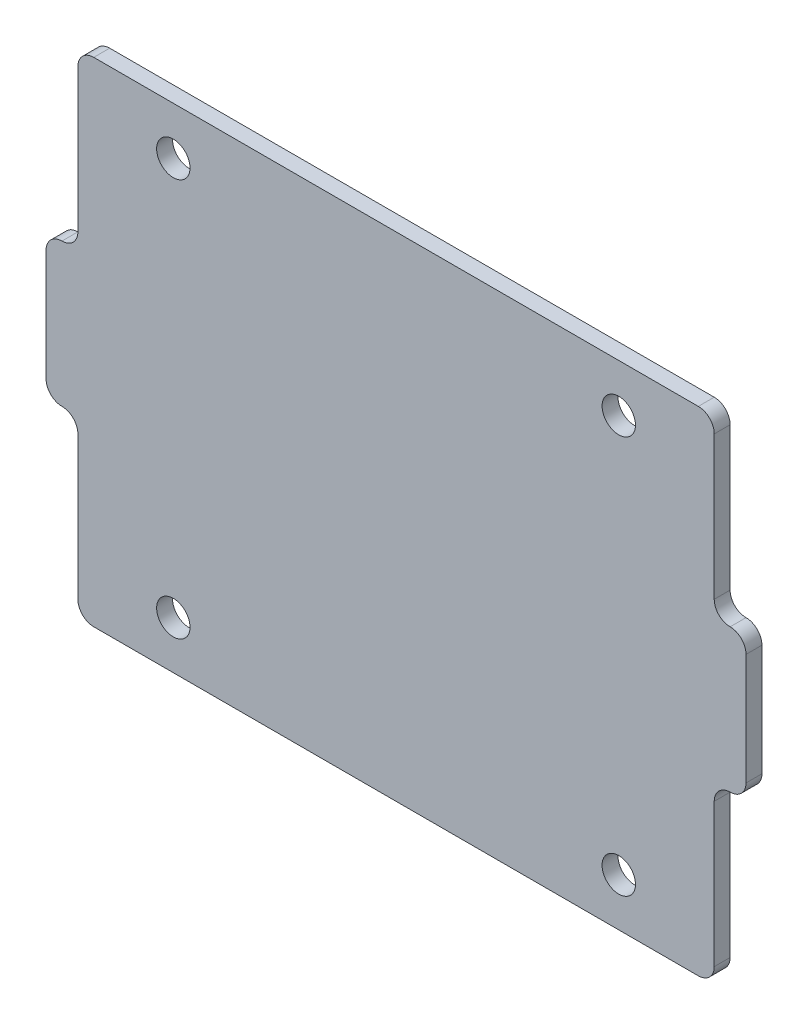
ISO-10303-21;
HEADER;
FILE_DESCRIPTION(('STEP AP214'),'2;1');
FILE_NAME('part.step','',(''),(''),'','','');
FILE_SCHEMA(('AUTOMOTIVE_DESIGN { 1 0 10303 214 1 1 1 1 }'));
ENDSEC;
DATA;
#1=APPLICATION_CONTEXT('core data for automotive mechanical design processes');
#2=APPLICATION_PROTOCOL_DEFINITION('international standard','automotive_design',2000,#1);
#3=PRODUCT_CONTEXT('',#1,'mechanical');
#4=PRODUCT('Part','Part','',(#3));
#5=PRODUCT_RELATED_PRODUCT_CATEGORY('part','',(#4));
#6=PRODUCT_DEFINITION_FORMATION('','',#4);
#7=PRODUCT_DEFINITION_CONTEXT('part definition',#1,'design');
#8=PRODUCT_DEFINITION('design','',#6,#7);
#9=PRODUCT_DEFINITION_SHAPE('','',#8);
#10=(LENGTH_UNIT() NAMED_UNIT(*) SI_UNIT(.MILLI.,.METRE.));
#11=(NAMED_UNIT(*) PLANE_ANGLE_UNIT() SI_UNIT($,.RADIAN.));
#12=(NAMED_UNIT(*) SI_UNIT($,.STERADIAN.) SOLID_ANGLE_UNIT());
#13=UNCERTAINTY_MEASURE_WITH_UNIT(LENGTH_MEASURE(1.E-05),#10,'distance_accuracy_value','');
#14=(GEOMETRIC_REPRESENTATION_CONTEXT(3) GLOBAL_UNCERTAINTY_ASSIGNED_CONTEXT((#13)) GLOBAL_UNIT_ASSIGNED_CONTEXT((#10,
#11,#12)) REPRESENTATION_CONTEXT('',''));
#15=CARTESIAN_POINT('',(0.,0.,0.));
#16=DIRECTION('',(0.,0.,1.));
#17=DIRECTION('',(1.,0.,0.));
#18=AXIS2_PLACEMENT_3D('',#15,#16,#17);
#19=CARTESIAN_POINT('',(-95.,26.,150.));
#20=DIRECTION('',(0.,0.,-1.));
#21=DIRECTION('',(-1.,0.,0.));
#22=AXIS2_PLACEMENT_3D('',#19,#20,#21);
#23=PLANE('',#22);
#24=DIRECTION('',(0.,1.,0.));
#25=VECTOR('',#24,1.);
#26=CARTESIAN_POINT('',(110.,121.,150.));
#27=LINE('',#26,#25);
#28=CARTESIAN_POINT('',(110.,81.0000000000001,150.));
#29=VERTEX_POINT('',#28);
#30=CARTESIAN_POINT('',(110.,116.,150.));
#31=VERTEX_POINT('',#30);
#32=EDGE_CURVE('E357',#29,#31,#27,.T.);
#33=ORIENTED_EDGE('',*,*,#32,.T.);
#34=CARTESIAN_POINT('',(105.,116.,150.));
#35=DIRECTION('',(0.,0.,-1.));
#36=DIRECTION('',(-1.,0.,0.));
#37=AXIS2_PLACEMENT_3D('',#34,#35,#36);
#38=CIRCLE('',#37,5.);
#39=CARTESIAN_POINT('',(105.,121.,150.));
#40=VERTEX_POINT('',#39);
#41=EDGE_CURVE('E224',#31,#40,#38,.F.);
#42=ORIENTED_EDGE('',*,*,#41,.T.);
#43=CARTESIAN_POINT('',(105.,126.,150.));
#44=DIRECTION('',(0.,0.,-1.));
#45=DIRECTION('',(-1.,0.,0.));
#46=AXIS2_PLACEMENT_3D('',#43,#44,#45);
#47=CIRCLE('',#46,5.);
#48=CARTESIAN_POINT('',(99.9999999999999,126.,150.));
#49=VERTEX_POINT('',#48);
#50=EDGE_CURVE('E240',#40,#49,#47,.T.);
#51=ORIENTED_EDGE('',*,*,#50,.T.);
#52=DIRECTION('',(0.,1.,0.));
#53=VECTOR('',#52,1.);
#54=CARTESIAN_POINT('',(100.,171.,150.));
#55=LINE('',#54,#53);
#56=CARTESIAN_POINT('',(100.,171.,150.));
#57=VERTEX_POINT('',#56);
#58=EDGE_CURVE('E361',#49,#57,#55,.T.);
#59=ORIENTED_EDGE('',*,*,#58,.T.);
#60=CARTESIAN_POINT('',(95.,171.,150.));
#61=DIRECTION('',(0.,0.,1.));
#62=DIRECTION('',(-1.,0.,0.));
#63=AXIS2_PLACEMENT_3D('',#60,#61,#62);
#64=CIRCLE('',#63,5.00000000000002);
#65=CARTESIAN_POINT('',(95.,176.,150.));
#66=VERTEX_POINT('',#65);
#67=EDGE_CURVE('E348',#57,#66,#64,.T.);
#68=ORIENTED_EDGE('',*,*,#67,.T.);
#69=DIRECTION('',(-1.,0.,0.));
#70=VECTOR('',#69,1.);
#71=CARTESIAN_POINT('',(-95.,176.,150.));
#72=LINE('',#71,#70);
#73=CARTESIAN_POINT('',(-95.,176.,150.));
#74=VERTEX_POINT('',#73);
#75=EDGE_CURVE('E344',#66,#74,#72,.T.);
#76=ORIENTED_EDGE('',*,*,#75,.T.);
#77=CARTESIAN_POINT('',(-95.,171.,150.));
#78=DIRECTION('',(0.,0.,1.));
#79=DIRECTION('',(-1.,0.,0.));
#80=AXIS2_PLACEMENT_3D('',#77,#78,#79);
#81=CIRCLE('',#80,5.00000000000002);
#82=CARTESIAN_POINT('',(-100.,171.,150.));
#83=VERTEX_POINT('',#82);
#84=EDGE_CURVE('E342',#74,#83,#81,.T.);
#85=ORIENTED_EDGE('',*,*,#84,.T.);
#86=DIRECTION('',(0.,-1.,0.));
#87=VECTOR('',#86,1.);
#88=CARTESIAN_POINT('',(-100.,171.,150.));
#89=LINE('',#88,#87);
#90=CARTESIAN_POINT('',(-100.,126.,150.));
#91=VERTEX_POINT('',#90);
#92=EDGE_CURVE('E343',#83,#91,#89,.T.);
#93=ORIENTED_EDGE('',*,*,#92,.T.);
#94=CARTESIAN_POINT('',(-105.,126.,150.));
#95=DIRECTION('',(0.,0.,-1.));
#96=DIRECTION('',(-1.,0.,0.));
#97=AXIS2_PLACEMENT_3D('',#94,#95,#96);
#98=CIRCLE('',#97,5.);
#99=CARTESIAN_POINT('',(-105.,121.,150.));
#100=VERTEX_POINT('',#99);
#101=EDGE_CURVE('E11',#91,#100,#98,.T.);
#102=ORIENTED_EDGE('',*,*,#101,.T.);
#103=CARTESIAN_POINT('',(-105.,116.,150.));
#104=DIRECTION('',(0.,0.,-1.));
#105=DIRECTION('',(-1.,0.,0.));
#106=AXIS2_PLACEMENT_3D('',#103,#104,#105);
#107=CIRCLE('',#106,5.);
#108=CARTESIAN_POINT('',(-110.,116.,150.));
#109=VERTEX_POINT('',#108);
#110=EDGE_CURVE('E219',#100,#109,#107,.F.);
#111=ORIENTED_EDGE('',*,*,#110,.T.);
#112=DIRECTION('',(0.,-1.,0.));
#113=VECTOR('',#112,1.);
#114=CARTESIAN_POINT('',(-110.,121.,150.));
#115=LINE('',#114,#113);
#116=CARTESIAN_POINT('',(-110.,81.0000000000001,150.));
#117=VERTEX_POINT('',#116);
#118=EDGE_CURVE('E346',#109,#117,#115,.T.);
#119=ORIENTED_EDGE('',*,*,#118,.T.);
#120=CARTESIAN_POINT('',(-105.,81.,150.));
#121=DIRECTION('',(0.,0.,-1.));
#122=DIRECTION('',(-1.,0.,0.));
#123=AXIS2_PLACEMENT_3D('',#120,#121,#122);
#124=CIRCLE('',#123,5.);
#125=CARTESIAN_POINT('',(-105.,76.,150.));
#126=VERTEX_POINT('',#125);
#127=EDGE_CURVE('E58',#117,#126,#124,.F.);
#128=ORIENTED_EDGE('',*,*,#127,.T.);
#129=CARTESIAN_POINT('',(-105.,71.,150.));
#130=DIRECTION('',(0.,0.,-1.));
#131=DIRECTION('',(-1.,0.,0.));
#132=AXIS2_PLACEMENT_3D('',#129,#130,#131);
#133=CIRCLE('',#132,5.);
#134=CARTESIAN_POINT('',(-100.,71.,150.));
#135=VERTEX_POINT('',#134);
#136=EDGE_CURVE('E53',#126,#135,#133,.T.);
#137=ORIENTED_EDGE('',*,*,#136,.T.);
#138=DIRECTION('',(0.,-1.,0.));
#139=VECTOR('',#138,1.);
#140=CARTESIAN_POINT('',(-100.,76.,150.));
#141=LINE('',#140,#139);
#142=CARTESIAN_POINT('',(-100.,26.,150.));
#143=VERTEX_POINT('',#142);
#144=EDGE_CURVE('E189',#135,#143,#141,.T.);
#145=ORIENTED_EDGE('',*,*,#144,.T.);
#146=CARTESIAN_POINT('',(-95.,26.,150.));
#147=DIRECTION('',(0.,0.,1.));
#148=DIRECTION('',(-1.,0.,0.));
#149=AXIS2_PLACEMENT_3D('',#146,#147,#148);
#150=CIRCLE('',#149,5.);
#151=CARTESIAN_POINT('',(-95.,21.,150.));
#152=VERTEX_POINT('',#151);
#153=EDGE_CURVE('E184',#143,#152,#150,.T.);
#154=ORIENTED_EDGE('',*,*,#153,.T.);
#155=DIRECTION('',(1.,0.,0.));
#156=VECTOR('',#155,1.);
#157=CARTESIAN_POINT('',(-95.,21.,150.));
#158=LINE('',#157,#156);
#159=CARTESIAN_POINT('',(95.,21.0000000000001,150.));
#160=VERTEX_POINT('',#159);
#161=EDGE_CURVE('E174',#152,#160,#158,.T.);
#162=ORIENTED_EDGE('',*,*,#161,.T.);
#163=CARTESIAN_POINT('',(95.,26.0000000000001,150.));
#164=DIRECTION('',(0.,0.,1.));
#165=DIRECTION('',(1.,0.,0.));
#166=AXIS2_PLACEMENT_3D('',#163,#164,#165);
#167=CIRCLE('',#166,5.);
#168=CARTESIAN_POINT('',(100.,26.0000000000001,150.));
#169=VERTEX_POINT('',#168);
#170=EDGE_CURVE('E183',#160,#169,#167,.T.);
#171=ORIENTED_EDGE('',*,*,#170,.T.);
#172=DIRECTION('',(0.,1.,0.));
#173=VECTOR('',#172,1.);
#174=CARTESIAN_POINT('',(100.,76.0000000000001,150.));
#175=LINE('',#174,#173);
#176=CARTESIAN_POINT('',(100.,71.0000000000001,150.));
#177=VERTEX_POINT('',#176);
#178=EDGE_CURVE('E316',#169,#177,#175,.T.);
#179=ORIENTED_EDGE('',*,*,#178,.T.);
#180=CARTESIAN_POINT('',(105.,71.0000000000001,150.));
#181=DIRECTION('',(0.,0.,-1.));
#182=DIRECTION('',(-1.,0.,0.));
#183=AXIS2_PLACEMENT_3D('',#180,#181,#182);
#184=CIRCLE('',#183,5.);
#185=CARTESIAN_POINT('',(105.,76.0000000000001,150.));
#186=VERTEX_POINT('',#185);
#187=EDGE_CURVE('E244',#177,#186,#184,.T.);
#188=ORIENTED_EDGE('',*,*,#187,.T.);
#189=CARTESIAN_POINT('',(105.,81.0000000000001,150.));
#190=DIRECTION('',(0.,0.,-1.));
#191=DIRECTION('',(-1.,0.,0.));
#192=AXIS2_PLACEMENT_3D('',#189,#190,#191);
#193=CIRCLE('',#192,5.);
#194=EDGE_CURVE('E222',#186,#29,#193,.F.);
#195=ORIENTED_EDGE('',*,*,#194,.T.);
#196=EDGE_LOOP('',(#33,#42,#51,#59,#68,#76,#85,#93,#102,#111,#119,#128,#137,#145,#154,#162,#171,
#179,#188,#195));
#197=FACE_BOUND('',#196,.T.);
#198=CARTESIAN_POINT('',(70.,161.,150.));
#199=DIRECTION('',(0.,0.,1.));
#200=DIRECTION('',(1.,0.,0.));
#201=AXIS2_PLACEMENT_3D('',#198,#199,#200);
#202=CIRCLE('',#201,5.25000000000002);
#203=CARTESIAN_POINT('',(75.25,161.,150.));
#204=VERTEX_POINT('',#203);
#205=EDGE_CURVE('E354',#204,#204,#202,.T.);
#206=ORIENTED_EDGE('',*,*,#205,.F.);
#207=EDGE_LOOP('',(#206));
#208=FACE_BOUND('',#207,.T.);
#209=CARTESIAN_POINT('',(70.,36.,150.));
#210=DIRECTION('',(0.,0.,1.));
#211=DIRECTION('',(1.,0.,0.));
#212=AXIS2_PLACEMENT_3D('',#209,#210,#211);
#213=CIRCLE('',#212,5.24999999999997);
#214=CARTESIAN_POINT('',(75.25,36.,150.));
#215=VERTEX_POINT('',#214);
#216=EDGE_CURVE('E465',#215,#215,#213,.T.);
#217=ORIENTED_EDGE('',*,*,#216,.F.);
#218=EDGE_LOOP('',(#217));
#219=FACE_BOUND('',#218,.T.);
#220=CARTESIAN_POINT('',(-70.,36.,150.));
#221=DIRECTION('',(0.,0.,1.));
#222=DIRECTION('',(1.,0.,0.));
#223=AXIS2_PLACEMENT_3D('',#220,#221,#222);
#224=CIRCLE('',#223,5.25);
#225=CARTESIAN_POINT('',(-64.75,36.,150.));
#226=VERTEX_POINT('',#225);
#227=EDGE_CURVE('E469',#226,#226,#224,.T.);
#228=ORIENTED_EDGE('',*,*,#227,.F.);
#229=EDGE_LOOP('',(#228));
#230=FACE_BOUND('',#229,.T.);
#231=CARTESIAN_POINT('',(-70.,161.,150.));
#232=DIRECTION('',(0.,0.,1.));
#233=DIRECTION('',(1.,0.,0.));
#234=AXIS2_PLACEMENT_3D('',#231,#232,#233);
#235=CIRCLE('',#234,5.25);
#236=CARTESIAN_POINT('',(-64.75,161.,150.));
#237=VERTEX_POINT('',#236);
#238=EDGE_CURVE('E490',#237,#237,#235,.T.);
#239=ORIENTED_EDGE('',*,*,#238,.F.);
#240=EDGE_LOOP('',(#239));
#241=FACE_BOUND('',#240,.T.);
#242=ADVANCED_FACE('F36',(#197,#208,#219,#230,#241),#23,.F.);
#243=CARTESIAN_POINT('',(-95.,26.,145.));
#244=DIRECTION('',(0.,0.,-1.));
#245=DIRECTION('',(-1.,0.,0.));
#246=AXIS2_PLACEMENT_3D('',#243,#244,#245);
#247=PLANE('',#246);
#248=CARTESIAN_POINT('',(-70.,36.,145.));
#249=DIRECTION('',(0.,0.,1.));
#250=DIRECTION('',(1.,0.,0.));
#251=AXIS2_PLACEMENT_3D('',#248,#249,#250);
#252=CIRCLE('',#251,5.25);
#253=CARTESIAN_POINT('',(-64.75,36.,145.));
#254=VERTEX_POINT('',#253);
#255=EDGE_CURVE('E474',#254,#254,#252,.T.);
#256=ORIENTED_EDGE('',*,*,#255,.T.);
#257=EDGE_LOOP('',(#256));
#258=FACE_BOUND('',#257,.T.);
#259=CARTESIAN_POINT('',(70.,161.,145.));
#260=DIRECTION('',(0.,0.,1.));
#261=DIRECTION('',(1.,0.,0.));
#262=AXIS2_PLACEMENT_3D('',#259,#260,#261);
#263=CIRCLE('',#262,5.25000000000002);
#264=CARTESIAN_POINT('',(75.25,161.,145.));
#265=VERTEX_POINT('',#264);
#266=EDGE_CURVE('E471',#265,#265,#263,.T.);
#267=ORIENTED_EDGE('',*,*,#266,.T.);
#268=EDGE_LOOP('',(#267));
#269=FACE_BOUND('',#268,.T.);
#270=DIRECTION('',(0.,1.,0.));
#271=VECTOR('',#270,1.);
#272=CARTESIAN_POINT('',(100.,171.,145.));
#273=LINE('',#272,#271);
#274=CARTESIAN_POINT('',(99.9999999999999,126.,145.));
#275=VERTEX_POINT('',#274);
#276=CARTESIAN_POINT('',(100.,171.,145.));
#277=VERTEX_POINT('',#276);
#278=EDGE_CURVE('E324',#275,#277,#273,.T.);
#279=ORIENTED_EDGE('',*,*,#278,.F.);
#280=CARTESIAN_POINT('',(105.,126.,145.));
#281=DIRECTION('',(0.,0.,-1.));
#282=DIRECTION('',(-1.,0.,0.));
#283=AXIS2_PLACEMENT_3D('',#280,#281,#282);
#284=CIRCLE('',#283,5.);
#285=CARTESIAN_POINT('',(105.,121.,145.));
#286=VERTEX_POINT('',#285);
#287=EDGE_CURVE('E238',#275,#286,#284,.F.);
#288=ORIENTED_EDGE('',*,*,#287,.T.);
#289=CARTESIAN_POINT('',(105.,116.,145.));
#290=DIRECTION('',(0.,0.,-1.));
#291=DIRECTION('',(-1.,0.,0.));
#292=AXIS2_PLACEMENT_3D('',#289,#290,#291);
#293=CIRCLE('',#292,5.);
#294=CARTESIAN_POINT('',(110.,116.,145.));
#295=VERTEX_POINT('',#294);
#296=EDGE_CURVE('E212',#286,#295,#293,.T.);
#297=ORIENTED_EDGE('',*,*,#296,.T.);
#298=DIRECTION('',(0.,1.,0.));
#299=VECTOR('',#298,1.);
#300=CARTESIAN_POINT('',(110.,121.,145.));
#301=LINE('',#300,#299);
#302=CARTESIAN_POINT('',(110.,81.0000000000001,145.));
#303=VERTEX_POINT('',#302);
#304=EDGE_CURVE('E321',#303,#295,#301,.T.);
#305=ORIENTED_EDGE('',*,*,#304,.F.);
#306=CARTESIAN_POINT('',(105.,81.0000000000001,145.));
#307=DIRECTION('',(0.,0.,-1.));
#308=DIRECTION('',(-1.,0.,0.));
#309=AXIS2_PLACEMENT_3D('',#306,#307,#308);
#310=CIRCLE('',#309,5.);
#311=CARTESIAN_POINT('',(105.,76.0000000000001,145.));
#312=VERTEX_POINT('',#311);
#313=EDGE_CURVE('E210',#303,#312,#310,.T.);
#314=ORIENTED_EDGE('',*,*,#313,.T.);
#315=CARTESIAN_POINT('',(105.,71.0000000000001,145.));
#316=DIRECTION('',(0.,0.,-1.));
#317=DIRECTION('',(-1.,0.,0.));
#318=AXIS2_PLACEMENT_3D('',#315,#316,#317);
#319=CIRCLE('',#318,5.);
#320=CARTESIAN_POINT('',(100.,71.0000000000001,145.));
#321=VERTEX_POINT('',#320);
#322=EDGE_CURVE('E242',#312,#321,#319,.F.);
#323=ORIENTED_EDGE('',*,*,#322,.T.);
#324=DIRECTION('',(0.,1.,0.));
#325=VECTOR('',#324,1.);
#326=CARTESIAN_POINT('',(100.,76.0000000000001,145.));
#327=LINE('',#326,#325);
#328=CARTESIAN_POINT('',(100.,26.0000000000001,145.));
#329=VERTEX_POINT('',#328);
#330=EDGE_CURVE('E313',#329,#321,#327,.T.);
#331=ORIENTED_EDGE('',*,*,#330,.F.);
#332=CARTESIAN_POINT('',(95.,26.0000000000001,145.));
#333=DIRECTION('',(0.,0.,1.));
#334=DIRECTION('',(1.,0.,0.));
#335=AXIS2_PLACEMENT_3D('',#332,#333,#334);
#336=CIRCLE('',#335,5.);
#337=CARTESIAN_POINT('',(95.,21.0000000000001,145.));
#338=VERTEX_POINT('',#337);
#339=EDGE_CURVE('E319',#338,#329,#336,.T.);
#340=ORIENTED_EDGE('',*,*,#339,.F.);
#341=DIRECTION('',(1.,0.,0.));
#342=VECTOR('',#341,1.);
#343=CARTESIAN_POINT('',(-95.,21.,145.));
#344=LINE('',#343,#342);
#345=CARTESIAN_POINT('',(-95.,21.,145.));
#346=VERTEX_POINT('',#345);
#347=EDGE_CURVE('E326',#346,#338,#344,.T.);
#348=ORIENTED_EDGE('',*,*,#347,.F.);
#349=CARTESIAN_POINT('',(-95.,26.,145.));
#350=DIRECTION('',(0.,0.,1.));
#351=DIRECTION('',(-1.,0.,0.));
#352=AXIS2_PLACEMENT_3D('',#349,#350,#351);
#353=CIRCLE('',#352,5.);
#354=CARTESIAN_POINT('',(-100.,26.,145.));
#355=VERTEX_POINT('',#354);
#356=EDGE_CURVE('E197',#355,#346,#353,.T.);
#357=ORIENTED_EDGE('',*,*,#356,.F.);
#358=DIRECTION('',(0.,-1.,0.));
#359=VECTOR('',#358,1.);
#360=CARTESIAN_POINT('',(-100.,76.,145.));
#361=LINE('',#360,#359);
#362=CARTESIAN_POINT('',(-100.,71.,145.));
#363=VERTEX_POINT('',#362);
#364=EDGE_CURVE('E193',#363,#355,#361,.T.);
#365=ORIENTED_EDGE('',*,*,#364,.F.);
#366=CARTESIAN_POINT('',(-105.,71.,145.));
#367=DIRECTION('',(0.,0.,-1.));
#368=DIRECTION('',(-1.,0.,0.));
#369=AXIS2_PLACEMENT_3D('',#366,#367,#368);
#370=CIRCLE('',#369,5.);
#371=CARTESIAN_POINT('',(-105.,76.,145.));
#372=VERTEX_POINT('',#371);
#373=EDGE_CURVE('E246',#363,#372,#370,.F.);
#374=ORIENTED_EDGE('',*,*,#373,.T.);
#375=CARTESIAN_POINT('',(-105.,81.,145.));
#376=DIRECTION('',(0.,0.,-1.));
#377=DIRECTION('',(-1.,0.,0.));
#378=AXIS2_PLACEMENT_3D('',#375,#376,#377);
#379=CIRCLE('',#378,5.);
#380=CARTESIAN_POINT('',(-110.,81.0000000000001,145.));
#381=VERTEX_POINT('',#380);
#382=EDGE_CURVE('E208',#372,#381,#379,.T.);
#383=ORIENTED_EDGE('',*,*,#382,.T.);
#384=DIRECTION('',(0.,-1.,0.));
#385=VECTOR('',#384,1.);
#386=CARTESIAN_POINT('',(-110.,121.,145.));
#387=LINE('',#386,#385);
#388=CARTESIAN_POINT('',(-110.,116.,145.));
#389=VERTEX_POINT('',#388);
#390=EDGE_CURVE('E285',#389,#381,#387,.T.);
#391=ORIENTED_EDGE('',*,*,#390,.F.);
#392=CARTESIAN_POINT('',(-105.,116.,145.));
#393=DIRECTION('',(0.,0.,-1.));
#394=DIRECTION('',(-1.,0.,0.));
#395=AXIS2_PLACEMENT_3D('',#392,#393,#394);
#396=CIRCLE('',#395,5.);
#397=CARTESIAN_POINT('',(-105.,121.,145.));
#398=VERTEX_POINT('',#397);
#399=EDGE_CURVE('E201',#389,#398,#396,.T.);
#400=ORIENTED_EDGE('',*,*,#399,.T.);
#401=CARTESIAN_POINT('',(-105.,126.,145.));
#402=DIRECTION('',(0.,0.,-1.));
#403=DIRECTION('',(-1.,0.,0.));
#404=AXIS2_PLACEMENT_3D('',#401,#402,#403);
#405=CIRCLE('',#404,5.);
#406=CARTESIAN_POINT('',(-100.,126.,145.));
#407=VERTEX_POINT('',#406);
#408=EDGE_CURVE('E45',#398,#407,#405,.F.);
#409=ORIENTED_EDGE('',*,*,#408,.T.);
#410=DIRECTION('',(0.,-1.,0.));
#411=VECTOR('',#410,1.);
#412=CARTESIAN_POINT('',(-100.,171.,145.));
#413=LINE('',#412,#411);
#414=CARTESIAN_POINT('',(-100.,171.,145.));
#415=VERTEX_POINT('',#414);
#416=EDGE_CURVE('E276',#415,#407,#413,.T.);
#417=ORIENTED_EDGE('',*,*,#416,.F.);
#418=CARTESIAN_POINT('',(-95.,171.,145.));
#419=DIRECTION('',(0.,0.,1.));
#420=DIRECTION('',(-1.,0.,0.));
#421=AXIS2_PLACEMENT_3D('',#418,#419,#420);
#422=CIRCLE('',#421,5.00000000000002);
#423=CARTESIAN_POINT('',(-95.,176.,145.));
#424=VERTEX_POINT('',#423);
#425=EDGE_CURVE('E286',#424,#415,#422,.T.);
#426=ORIENTED_EDGE('',*,*,#425,.F.);
#427=DIRECTION('',(-1.,0.,0.));
#428=VECTOR('',#427,1.);
#429=CARTESIAN_POINT('',(-95.,176.,145.));
#430=LINE('',#429,#428);
#431=CARTESIAN_POINT('',(95.,176.,145.));
#432=VERTEX_POINT('',#431);
#433=EDGE_CURVE('E290',#432,#424,#430,.T.);
#434=ORIENTED_EDGE('',*,*,#433,.F.);
#435=CARTESIAN_POINT('',(95.,171.,145.));
#436=DIRECTION('',(0.,0.,1.));
#437=DIRECTION('',(-1.,0.,0.));
#438=AXIS2_PLACEMENT_3D('',#435,#436,#437);
#439=CIRCLE('',#438,5.00000000000002);
#440=EDGE_CURVE('E331',#277,#432,#439,.T.);
#441=ORIENTED_EDGE('',*,*,#440,.F.);
#442=EDGE_LOOP('',(#279,#288,#297,#305,#314,#323,#331,#340,#348,#357,#365,#374,#383,#391,#400,
#409,#417,#426,#434,#441));
#443=FACE_BOUND('',#442,.T.);
#444=CARTESIAN_POINT('',(70.,36.,145.));
#445=DIRECTION('',(0.,0.,1.));
#446=DIRECTION('',(1.,0.,0.));
#447=AXIS2_PLACEMENT_3D('',#444,#445,#446);
#448=CIRCLE('',#447,5.24999999999997);
#449=CARTESIAN_POINT('',(75.25,36.,145.));
#450=VERTEX_POINT('',#449);
#451=EDGE_CURVE('E468',#450,#450,#448,.T.);
#452=ORIENTED_EDGE('',*,*,#451,.T.);
#453=EDGE_LOOP('',(#452));
#454=FACE_BOUND('',#453,.T.);
#455=CARTESIAN_POINT('',(-70.,161.,145.));
#456=DIRECTION('',(0.,0.,1.));
#457=DIRECTION('',(1.,0.,0.));
#458=AXIS2_PLACEMENT_3D('',#455,#456,#457);
#459=CIRCLE('',#458,5.25);
#460=CARTESIAN_POINT('',(-64.75,161.,145.));
#461=VERTEX_POINT('',#460);
#462=EDGE_CURVE('E253',#461,#461,#459,.T.);
#463=ORIENTED_EDGE('',*,*,#462,.T.);
#464=EDGE_LOOP('',(#463));
#465=FACE_BOUND('',#464,.T.);
#466=ADVANCED_FACE('F273',(#258,#269,#443,#454,#465),#247,.T.);
#467=CARTESIAN_POINT('',(-95.,26.,150.));
#468=DIRECTION('',(0.,0.,-1.));
#469=DIRECTION('',(-1.,0.,0.));
#470=AXIS2_PLACEMENT_3D('',#467,#468,#469);
#471=CYLINDRICAL_SURFACE('',#470,5.);
#472=ORIENTED_EDGE('',*,*,#356,.T.);
#473=DIRECTION('',(0.,0.,-1.));
#474=VECTOR('',#473,1.);
#475=CARTESIAN_POINT('',(-95.,21.,150.));
#476=LINE('',#475,#474);
#477=EDGE_CURVE('E178',#152,#346,#476,.T.);
#478=ORIENTED_EDGE('',*,*,#477,.F.);
#479=ORIENTED_EDGE('',*,*,#153,.F.);
#480=DIRECTION('',(0.,0.,-1.));
#481=VECTOR('',#480,1.);
#482=CARTESIAN_POINT('',(-100.,26.,150.));
#483=LINE('',#482,#481);
#484=EDGE_CURVE('E295',#143,#355,#483,.T.);
#485=ORIENTED_EDGE('',*,*,#484,.T.);
#486=EDGE_LOOP('',(#472,#478,#479,#485));
#487=FACE_BOUND('',#486,.T.);
#488=ADVANCED_FACE('F195',(#487),#471,.T.);
#489=CARTESIAN_POINT('',(-95.,21.,150.));
#490=DIRECTION('',(0.,1.,0.));
#491=DIRECTION('',(-1.,0.,0.));
#492=AXIS2_PLACEMENT_3D('',#489,#490,#491);
#493=PLANE('',#492);
#494=ORIENTED_EDGE('',*,*,#347,.T.);
#495=DIRECTION('',(0.,0.,-1.));
#496=VECTOR('',#495,1.);
#497=CARTESIAN_POINT('',(95.,21.0000000000001,150.));
#498=LINE('',#497,#496);
#499=EDGE_CURVE('E181',#160,#338,#498,.T.);
#500=ORIENTED_EDGE('',*,*,#499,.F.);
#501=ORIENTED_EDGE('',*,*,#161,.F.);
#502=ORIENTED_EDGE('',*,*,#477,.T.);
#503=EDGE_LOOP('',(#494,#500,#501,#502));
#504=FACE_BOUND('',#503,.T.);
#505=ADVANCED_FACE('F176',(#504),#493,.F.);
#506=CARTESIAN_POINT('',(95.,26.0000000000001,150.));
#507=DIRECTION('',(0.,0.,-1.));
#508=DIRECTION('',(-1.,0.,0.));
#509=AXIS2_PLACEMENT_3D('',#506,#507,#508);
#510=CYLINDRICAL_SURFACE('',#509,5.);
#511=ORIENTED_EDGE('',*,*,#339,.T.);
#512=DIRECTION('',(0.,0.,-1.));
#513=VECTOR('',#512,1.);
#514=CARTESIAN_POINT('',(100.,26.0000000000001,150.));
#515=LINE('',#514,#513);
#516=EDGE_CURVE('E203',#169,#329,#515,.T.);
#517=ORIENTED_EDGE('',*,*,#516,.F.);
#518=ORIENTED_EDGE('',*,*,#170,.F.);
#519=ORIENTED_EDGE('',*,*,#499,.T.);
#520=EDGE_LOOP('',(#511,#517,#518,#519));
#521=FACE_BOUND('',#520,.T.);
#522=ADVANCED_FACE('F355',(#521),#510,.T.);
#523=CARTESIAN_POINT('',(100.,76.0000000000001,150.));
#524=DIRECTION('',(-1.,0.,0.));
#525=DIRECTION('',(0.,-1.,0.));
#526=AXIS2_PLACEMENT_3D('',#523,#524,#525);
#527=PLANE('',#526);
#528=ORIENTED_EDGE('',*,*,#330,.T.);
#529=DIRECTION('',(0.,0.,-1.));
#530=VECTOR('',#529,1.);
#531=CARTESIAN_POINT('',(100.,71.0000000000001,150.));
#532=LINE('',#531,#530);
#533=EDGE_CURVE('E226',#321,#177,#532,.F.);
#534=ORIENTED_EDGE('',*,*,#533,.T.);
#535=ORIENTED_EDGE('',*,*,#178,.F.);
#536=ORIENTED_EDGE('',*,*,#516,.T.);
#537=EDGE_LOOP('',(#528,#534,#535,#536));
#538=FACE_BOUND('',#537,.T.);
#539=ADVANCED_FACE('F312',(#538),#527,.F.);
#540=CARTESIAN_POINT('',(110.,121.,150.));
#541=DIRECTION('',(-1.,0.,0.));
#542=DIRECTION('',(0.,-1.,0.));
#543=AXIS2_PLACEMENT_3D('',#540,#541,#542);
#544=PLANE('',#543);
#545=ORIENTED_EDGE('',*,*,#304,.T.);
#546=DIRECTION('',(0.,0.,-1.));
#547=VECTOR('',#546,1.);
#548=CARTESIAN_POINT('',(110.,116.,150.));
#549=LINE('',#548,#547);
#550=EDGE_CURVE('E217',#295,#31,#549,.F.);
#551=ORIENTED_EDGE('',*,*,#550,.T.);
#552=ORIENTED_EDGE('',*,*,#32,.F.);
#553=DIRECTION('',(0.,0.,-1.));
#554=VECTOR('',#553,1.);
#555=CARTESIAN_POINT('',(110.,81.0000000000001,150.));
#556=LINE('',#555,#554);
#557=EDGE_CURVE('E214',#29,#303,#556,.T.);
#558=ORIENTED_EDGE('',*,*,#557,.T.);
#559=EDGE_LOOP('',(#545,#551,#552,#558));
#560=FACE_BOUND('',#559,.T.);
#561=ADVANCED_FACE('F381',(#560),#544,.F.);
#562=CARTESIAN_POINT('',(100.,171.,150.));
#563=DIRECTION('',(-1.,0.,0.));
#564=DIRECTION('',(0.,-1.,0.));
#565=AXIS2_PLACEMENT_3D('',#562,#563,#564);
#566=PLANE('',#565);
#567=ORIENTED_EDGE('',*,*,#58,.F.);
#568=DIRECTION('',(0.,0.,-1.));
#569=VECTOR('',#568,1.);
#570=CARTESIAN_POINT('',(99.9999999999999,126.,145.));
#571=LINE('',#570,#569);
#572=EDGE_CURVE('E198',#49,#275,#571,.T.);
#573=ORIENTED_EDGE('',*,*,#572,.T.);
#574=ORIENTED_EDGE('',*,*,#278,.T.);
#575=DIRECTION('',(0.,0.,-1.));
#576=VECTOR('',#575,1.);
#577=CARTESIAN_POINT('',(100.,171.,150.));
#578=LINE('',#577,#576);
#579=EDGE_CURVE('E304',#57,#277,#578,.T.);
#580=ORIENTED_EDGE('',*,*,#579,.F.);
#581=EDGE_LOOP('',(#567,#573,#574,#580));
#582=FACE_BOUND('',#581,.T.);
#583=ADVANCED_FACE('F369',(#582),#566,.F.);
#584=CARTESIAN_POINT('',(95.,171.,150.));
#585=DIRECTION('',(0.,0.,-1.));
#586=DIRECTION('',(-1.,0.,0.));
#587=AXIS2_PLACEMENT_3D('',#584,#585,#586);
#588=CYLINDRICAL_SURFACE('',#587,5.00000000000002);
#589=ORIENTED_EDGE('',*,*,#440,.T.);
#590=DIRECTION('',(0.,0.,-1.));
#591=VECTOR('',#590,1.);
#592=CARTESIAN_POINT('',(95.,176.,150.));
#593=LINE('',#592,#591);
#594=EDGE_CURVE('E301',#66,#432,#593,.T.);
#595=ORIENTED_EDGE('',*,*,#594,.F.);
#596=ORIENTED_EDGE('',*,*,#67,.F.);
#597=ORIENTED_EDGE('',*,*,#579,.T.);
#598=EDGE_LOOP('',(#589,#595,#596,#597));
#599=FACE_BOUND('',#598,.T.);
#600=ADVANCED_FACE('F366',(#599),#588,.T.);
#601=CARTESIAN_POINT('',(-95.,176.,150.));
#602=DIRECTION('',(0.,-1.,0.));
#603=DIRECTION('',(1.,0.,0.));
#604=AXIS2_PLACEMENT_3D('',#601,#602,#603);
#605=PLANE('',#604);
#606=ORIENTED_EDGE('',*,*,#433,.T.);
#607=DIRECTION('',(0.,0.,-1.));
#608=VECTOR('',#607,1.);
#609=CARTESIAN_POINT('',(-95.,176.,150.));
#610=LINE('',#609,#608);
#611=EDGE_CURVE('E298',#74,#424,#610,.T.);
#612=ORIENTED_EDGE('',*,*,#611,.F.);
#613=ORIENTED_EDGE('',*,*,#75,.F.);
#614=ORIENTED_EDGE('',*,*,#594,.T.);
#615=EDGE_LOOP('',(#606,#612,#613,#614));
#616=FACE_BOUND('',#615,.T.);
#617=ADVANCED_FACE('F335',(#616),#605,.F.);
#618=CARTESIAN_POINT('',(-95.,171.,150.));
#619=DIRECTION('',(0.,0.,-1.));
#620=DIRECTION('',(-1.,0.,0.));
#621=AXIS2_PLACEMENT_3D('',#618,#619,#620);
#622=CYLINDRICAL_SURFACE('',#621,5.00000000000002);
#623=ORIENTED_EDGE('',*,*,#425,.T.);
#624=DIRECTION('',(0.,0.,-1.));
#625=VECTOR('',#624,1.);
#626=CARTESIAN_POINT('',(-100.,171.,150.));
#627=LINE('',#626,#625);
#628=EDGE_CURVE('E284',#83,#415,#627,.T.);
#629=ORIENTED_EDGE('',*,*,#628,.F.);
#630=ORIENTED_EDGE('',*,*,#84,.F.);
#631=ORIENTED_EDGE('',*,*,#611,.T.);
#632=EDGE_LOOP('',(#623,#629,#630,#631));
#633=FACE_BOUND('',#632,.T.);
#634=ADVANCED_FACE('F341',(#633),#622,.T.);
#635=CARTESIAN_POINT('',(-100.,171.,150.));
#636=DIRECTION('',(1.,0.,0.));
#637=DIRECTION('',(0.,1.,0.));
#638=AXIS2_PLACEMENT_3D('',#635,#636,#637);
#639=PLANE('',#638);
#640=ORIENTED_EDGE('',*,*,#416,.T.);
#641=DIRECTION('',(0.,0.,-1.));
#642=VECTOR('',#641,1.);
#643=CARTESIAN_POINT('',(-100.,126.,150.));
#644=LINE('',#643,#642);
#645=EDGE_CURVE('E236',#407,#91,#644,.F.);
#646=ORIENTED_EDGE('',*,*,#645,.T.);
#647=ORIENTED_EDGE('',*,*,#92,.F.);
#648=ORIENTED_EDGE('',*,*,#628,.T.);
#649=EDGE_LOOP('',(#640,#646,#647,#648));
#650=FACE_BOUND('',#649,.T.);
#651=ADVANCED_FACE('F280',(#650),#639,.F.);
#652=CARTESIAN_POINT('',(-110.,121.,150.));
#653=DIRECTION('',(1.,0.,0.));
#654=DIRECTION('',(0.,0.,-1.));
#655=AXIS2_PLACEMENT_3D('',#652,#653,#654);
#656=PLANE('',#655);
#657=ORIENTED_EDGE('',*,*,#390,.T.);
#658=DIRECTION('',(0.,0.,-1.));
#659=VECTOR('',#658,1.);
#660=CARTESIAN_POINT('',(-110.,81.,150.));
#661=LINE('',#660,#659);
#662=EDGE_CURVE('E234',#381,#117,#661,.F.);
#663=ORIENTED_EDGE('',*,*,#662,.T.);
#664=ORIENTED_EDGE('',*,*,#118,.F.);
#665=DIRECTION('',(0.,0.,-1.));
#666=VECTOR('',#665,1.);
#667=CARTESIAN_POINT('',(-110.,116.,150.));
#668=LINE('',#667,#666);
#669=EDGE_CURVE('E231',#109,#389,#668,.T.);
#670=ORIENTED_EDGE('',*,*,#669,.T.);
#671=EDGE_LOOP('',(#657,#663,#664,#670));
#672=FACE_BOUND('',#671,.T.);
#673=ADVANCED_FACE('F415',(#672),#656,.F.);
#674=CARTESIAN_POINT('',(-100.,76.,150.));
#675=DIRECTION('',(1.,0.,0.));
#676=DIRECTION('',(0.,0.,-1.));
#677=AXIS2_PLACEMENT_3D('',#674,#675,#676);
#678=PLANE('',#677);
#679=ORIENTED_EDGE('',*,*,#144,.F.);
#680=DIRECTION('',(0.,0.,-1.));
#681=VECTOR('',#680,1.);
#682=CARTESIAN_POINT('',(-100.,71.,145.));
#683=LINE('',#682,#681);
#684=EDGE_CURVE('E228',#135,#363,#683,.T.);
#685=ORIENTED_EDGE('',*,*,#684,.T.);
#686=ORIENTED_EDGE('',*,*,#364,.T.);
#687=ORIENTED_EDGE('',*,*,#484,.F.);
#688=EDGE_LOOP('',(#679,#685,#686,#687));
#689=FACE_BOUND('',#688,.T.);
#690=ADVANCED_FACE('F412',(#689),#678,.F.);
#691=CARTESIAN_POINT('',(70.,161.,150.));
#692=DIRECTION('',(0.,0.,-1.));
#693=DIRECTION('',(-1.,0.,0.));
#694=AXIS2_PLACEMENT_3D('',#691,#692,#693);
#695=CYLINDRICAL_SURFACE('',#694,5.25000000000002);
#696=ORIENTED_EDGE('',*,*,#205,.T.);
#697=EDGE_LOOP('',(#696));
#698=FACE_BOUND('',#697,.T.);
#699=ORIENTED_EDGE('',*,*,#266,.F.);
#700=EDGE_LOOP('',(#699));
#701=FACE_BOUND('',#700,.T.);
#702=ADVANCED_FACE('F409',(#698,#701),#695,.F.);
#703=CARTESIAN_POINT('',(70.,36.,150.));
#704=DIRECTION('',(0.,0.,-1.));
#705=DIRECTION('',(-1.,0.,0.));
#706=AXIS2_PLACEMENT_3D('',#703,#704,#705);
#707=CYLINDRICAL_SURFACE('',#706,5.24999999999997);
#708=ORIENTED_EDGE('',*,*,#216,.T.);
#709=EDGE_LOOP('',(#708));
#710=FACE_BOUND('',#709,.T.);
#711=ORIENTED_EDGE('',*,*,#451,.F.);
#712=EDGE_LOOP('',(#711));
#713=FACE_BOUND('',#712,.T.);
#714=ADVANCED_FACE('F451',(#710,#713),#707,.F.);
#715=CARTESIAN_POINT('',(-70.,36.,150.));
#716=DIRECTION('',(0.,0.,-1.));
#717=DIRECTION('',(-1.,0.,0.));
#718=AXIS2_PLACEMENT_3D('',#715,#716,#717);
#719=CYLINDRICAL_SURFACE('',#718,5.25);
#720=ORIENTED_EDGE('',*,*,#227,.T.);
#721=EDGE_LOOP('',(#720));
#722=FACE_BOUND('',#721,.T.);
#723=ORIENTED_EDGE('',*,*,#255,.F.);
#724=EDGE_LOOP('',(#723));
#725=FACE_BOUND('',#724,.T.);
#726=ADVANCED_FACE('F445',(#722,#725),#719,.F.);
#727=CARTESIAN_POINT('',(-70.,161.,150.));
#728=DIRECTION('',(0.,0.,-1.));
#729=DIRECTION('',(-1.,0.,0.));
#730=AXIS2_PLACEMENT_3D('',#727,#728,#729);
#731=CYLINDRICAL_SURFACE('',#730,5.25);
#732=ORIENTED_EDGE('',*,*,#238,.T.);
#733=EDGE_LOOP('',(#732));
#734=FACE_BOUND('',#733,.T.);
#735=ORIENTED_EDGE('',*,*,#462,.F.);
#736=EDGE_LOOP('',(#735));
#737=FACE_BOUND('',#736,.T.);
#738=ADVANCED_FACE('F441',(#734,#737),#731,.F.);
#739=CARTESIAN_POINT('',(105.,116.,150.));
#740=DIRECTION('',(0.,0.,-1.));
#741=DIRECTION('',(-1.,0.,0.));
#742=AXIS2_PLACEMENT_3D('',#739,#740,#741);
#743=CYLINDRICAL_SURFACE('',#742,5.);
#744=DIRECTION('',(0.,0.,-1.));
#745=VECTOR('',#744,1.);
#746=CARTESIAN_POINT('',(105.,121.,150.));
#747=LINE('',#746,#745);
#748=EDGE_CURVE('E250',#40,#286,#747,.T.);
#749=ORIENTED_EDGE('',*,*,#748,.F.);
#750=ORIENTED_EDGE('',*,*,#41,.F.);
#751=ORIENTED_EDGE('',*,*,#550,.F.);
#752=ORIENTED_EDGE('',*,*,#296,.F.);
#753=EDGE_LOOP('',(#749,#750,#751,#752));
#754=FACE_BOUND('',#753,.T.);
#755=ADVANCED_FACE('F377',(#754),#743,.T.);
#756=CARTESIAN_POINT('',(105.,126.,150.));
#757=DIRECTION('',(0.,0.,1.));
#758=DIRECTION('',(1.,0.,0.));
#759=AXIS2_PLACEMENT_3D('',#756,#757,#758);
#760=CYLINDRICAL_SURFACE('',#759,5.);
#761=ORIENTED_EDGE('',*,*,#50,.F.);
#762=ORIENTED_EDGE('',*,*,#748,.T.);
#763=ORIENTED_EDGE('',*,*,#287,.F.);
#764=ORIENTED_EDGE('',*,*,#572,.F.);
#765=EDGE_LOOP('',(#761,#762,#763,#764));
#766=FACE_BOUND('',#765,.T.);
#767=ADVANCED_FACE('F373',(#766),#760,.F.);
#768=CARTESIAN_POINT('',(105.,71.0000000000001,150.));
#769=DIRECTION('',(0.,0.,1.));
#770=DIRECTION('',(1.,0.,0.));
#771=AXIS2_PLACEMENT_3D('',#768,#769,#770);
#772=CYLINDRICAL_SURFACE('',#771,5.);
#773=DIRECTION('',(0.,0.,-1.));
#774=VECTOR('',#773,1.);
#775=CARTESIAN_POINT('',(105.,76.0000000000001,145.));
#776=LINE('',#775,#774);
#777=EDGE_CURVE('E254',#186,#312,#776,.T.);
#778=ORIENTED_EDGE('',*,*,#777,.F.);
#779=ORIENTED_EDGE('',*,*,#187,.F.);
#780=ORIENTED_EDGE('',*,*,#533,.F.);
#781=ORIENTED_EDGE('',*,*,#322,.F.);
#782=EDGE_LOOP('',(#778,#779,#780,#781));
#783=FACE_BOUND('',#782,.T.);
#784=ADVANCED_FACE('F389',(#783),#772,.F.);
#785=CARTESIAN_POINT('',(105.,81.0000000000001,150.));
#786=DIRECTION('',(0.,0.,-1.));
#787=DIRECTION('',(-1.,0.,0.));
#788=AXIS2_PLACEMENT_3D('',#785,#786,#787);
#789=CYLINDRICAL_SURFACE('',#788,5.);
#790=ORIENTED_EDGE('',*,*,#194,.F.);
#791=ORIENTED_EDGE('',*,*,#777,.T.);
#792=ORIENTED_EDGE('',*,*,#313,.F.);
#793=ORIENTED_EDGE('',*,*,#557,.F.);
#794=EDGE_LOOP('',(#790,#791,#792,#793));
#795=FACE_BOUND('',#794,.T.);
#796=ADVANCED_FACE('F386',(#795),#789,.T.);
#797=CARTESIAN_POINT('',(-105.,81.,150.));
#798=DIRECTION('',(0.,0.,-1.));
#799=DIRECTION('',(-1.,0.,0.));
#800=AXIS2_PLACEMENT_3D('',#797,#798,#799);
#801=CYLINDRICAL_SURFACE('',#800,5.);
#802=DIRECTION('',(0.,0.,-1.));
#803=VECTOR('',#802,1.);
#804=CARTESIAN_POINT('',(-105.,76.,150.));
#805=LINE('',#804,#803);
#806=EDGE_CURVE('E256',#126,#372,#805,.T.);
#807=ORIENTED_EDGE('',*,*,#806,.F.);
#808=ORIENTED_EDGE('',*,*,#127,.F.);
#809=ORIENTED_EDGE('',*,*,#662,.F.);
#810=ORIENTED_EDGE('',*,*,#382,.F.);
#811=EDGE_LOOP('',(#807,#808,#809,#810));
#812=FACE_BOUND('',#811,.T.);
#813=ADVANCED_FACE('F397',(#812),#801,.T.);
#814=CARTESIAN_POINT('',(-105.,71.,150.));
#815=DIRECTION('',(0.,0.,1.));
#816=DIRECTION('',(1.,0.,0.));
#817=AXIS2_PLACEMENT_3D('',#814,#815,#816);
#818=CYLINDRICAL_SURFACE('',#817,5.);
#819=ORIENTED_EDGE('',*,*,#136,.F.);
#820=ORIENTED_EDGE('',*,*,#806,.T.);
#821=ORIENTED_EDGE('',*,*,#373,.F.);
#822=ORIENTED_EDGE('',*,*,#684,.F.);
#823=EDGE_LOOP('',(#819,#820,#821,#822));
#824=FACE_BOUND('',#823,.T.);
#825=ADVANCED_FACE('F598',(#824),#818,.F.);
#826=CARTESIAN_POINT('',(-105.,126.,150.));
#827=DIRECTION('',(0.,0.,1.));
#828=DIRECTION('',(1.,0.,0.));
#829=AXIS2_PLACEMENT_3D('',#826,#827,#828);
#830=CYLINDRICAL_SURFACE('',#829,5.);
#831=DIRECTION('',(0.,0.,-1.));
#832=VECTOR('',#831,1.);
#833=CARTESIAN_POINT('',(-105.,121.,145.));
#834=LINE('',#833,#832);
#835=EDGE_CURVE('E40',#100,#398,#834,.T.);
#836=ORIENTED_EDGE('',*,*,#835,.F.);
#837=ORIENTED_EDGE('',*,*,#101,.F.);
#838=ORIENTED_EDGE('',*,*,#645,.F.);
#839=ORIENTED_EDGE('',*,*,#408,.F.);
#840=EDGE_LOOP('',(#836,#837,#838,#839));
#841=FACE_BOUND('',#840,.T.);
#842=ADVANCED_FACE('F38',(#841),#830,.F.);
#843=CARTESIAN_POINT('',(-105.,116.,150.));
#844=DIRECTION('',(0.,0.,-1.));
#845=DIRECTION('',(-1.,0.,0.));
#846=AXIS2_PLACEMENT_3D('',#843,#844,#845);
#847=CYLINDRICAL_SURFACE('',#846,5.);
#848=ORIENTED_EDGE('',*,*,#110,.F.);
#849=ORIENTED_EDGE('',*,*,#835,.T.);
#850=ORIENTED_EDGE('',*,*,#399,.F.);
#851=ORIENTED_EDGE('',*,*,#669,.F.);
#852=EDGE_LOOP('',(#848,#849,#850,#851));
#853=FACE_BOUND('',#852,.T.);
#854=ADVANCED_FACE('F263',(#853),#847,.T.);
#855=CLOSED_SHELL('',(#242,#466,#488,#505,#522,#539,#561,#583,#600,#617,#634,#651,#673,#690,
#702,#714,#726,#738,#755,#767,#784,#796,#813,#825,#842,#854));
#856=MANIFOLD_SOLID_BREP('B2',#855);
#857=ADVANCED_BREP_SHAPE_REPRESENTATION('',(#18,#856),#14);
#858=SHAPE_DEFINITION_REPRESENTATION(#9,#857);
ENDSEC;
END-ISO-10303-21;
